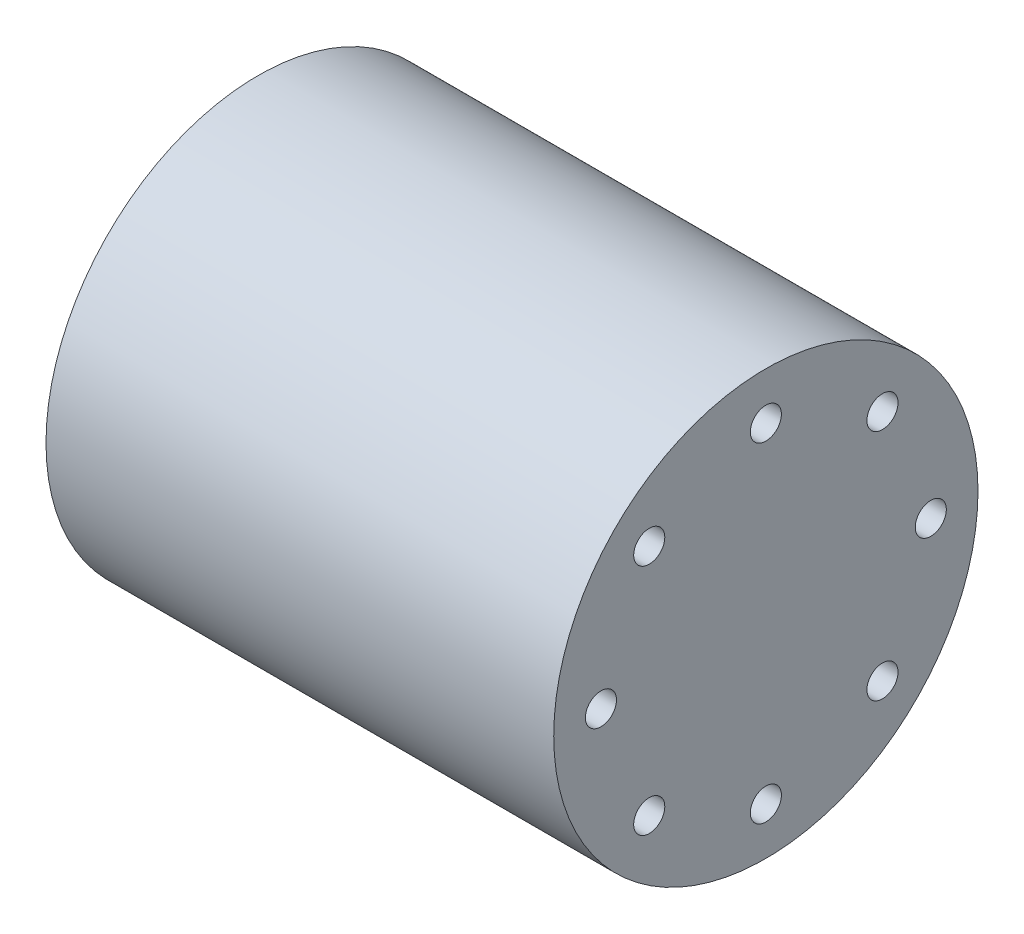
ISO-10303-21;
HEADER;
FILE_DESCRIPTION(('STEP AP214'),'2;1');
FILE_NAME('part.step','',(''),(''),'','','');
FILE_SCHEMA(('AUTOMOTIVE_DESIGN { 1 0 10303 214 1 1 1 1 }'));
ENDSEC;
DATA;
#1=APPLICATION_CONTEXT('core data for automotive mechanical design processes');
#2=APPLICATION_PROTOCOL_DEFINITION('international standard','automotive_design',2000,#1);
#3=PRODUCT_CONTEXT('',#1,'mechanical');
#4=PRODUCT('Part','Part','',(#3));
#5=PRODUCT_RELATED_PRODUCT_CATEGORY('part','',(#4));
#6=PRODUCT_DEFINITION_FORMATION('','',#4);
#7=PRODUCT_DEFINITION_CONTEXT('part definition',#1,'design');
#8=PRODUCT_DEFINITION('design','',#6,#7);
#9=PRODUCT_DEFINITION_SHAPE('','',#8);
#10=(LENGTH_UNIT() NAMED_UNIT(*) SI_UNIT(.MILLI.,.METRE.));
#11=(NAMED_UNIT(*) PLANE_ANGLE_UNIT() SI_UNIT($,.RADIAN.));
#12=(NAMED_UNIT(*) SI_UNIT($,.STERADIAN.) SOLID_ANGLE_UNIT());
#13=UNCERTAINTY_MEASURE_WITH_UNIT(LENGTH_MEASURE(1.E-05),#10,'distance_accuracy_value','');
#14=(GEOMETRIC_REPRESENTATION_CONTEXT(3) GLOBAL_UNCERTAINTY_ASSIGNED_CONTEXT((#13)) GLOBAL_UNIT_ASSIGNED_CONTEXT((#10,
#11,#12)) REPRESENTATION_CONTEXT('',''));
#15=CARTESIAN_POINT('',(0.,0.,0.));
#16=DIRECTION('',(0.,0.,1.));
#17=DIRECTION('',(1.,0.,0.));
#18=AXIS2_PLACEMENT_3D('',#15,#16,#17);
#19=CARTESIAN_POINT('',(-7.25,0.,0.));
#20=DIRECTION('',(1.,0.,0.));
#21=DIRECTION('',(0.,1.,0.));
#22=AXIS2_PLACEMENT_3D('',#19,#20,#21);
#23=PLANE('',#22);
#24=CARTESIAN_POINT('',(-7.25,17.5,0.));
#25=DIRECTION('',(1.,0.,0.));
#26=DIRECTION('',(0.,0.,-1.));
#27=AXIS2_PLACEMENT_3D('',#24,#25,#26);
#28=CIRCLE('',#27,1.65);
#29=CARTESIAN_POINT('',(-7.25,17.5,-1.65));
#30=VERTEX_POINT('',#29);
#31=EDGE_CURVE('E11',#30,#30,#28,.T.);
#32=ORIENTED_EDGE('',*,*,#31,.F.);
#33=EDGE_LOOP('',(#32));
#34=FACE_BOUND('',#33,.T.);
#35=ADVANCED_FACE('F16',(#34),#23,.F.);
#36=CARTESIAN_POINT('',(-7.25,17.5,0.));
#37=DIRECTION('',(-1.,0.,0.));
#38=DIRECTION('',(0.,0.,1.));
#39=AXIS2_PLACEMENT_3D('',#36,#37,#38);
#40=CYLINDRICAL_SURFACE('',#39,1.65);
#41=CARTESIAN_POINT('',(-27.25,17.5,0.));
#42=DIRECTION('',(1.,0.,0.));
#43=DIRECTION('',(0.,0.,-1.));
#44=AXIS2_PLACEMENT_3D('',#41,#42,#43);
#45=CIRCLE('',#44,1.65);
#46=CARTESIAN_POINT('',(-27.25,17.5,-1.65));
#47=VERTEX_POINT('',#46);
#48=EDGE_CURVE('E202',#47,#47,#45,.T.);
#49=ORIENTED_EDGE('',*,*,#48,.F.);
#50=EDGE_LOOP('',(#49));
#51=FACE_BOUND('',#50,.T.);
#52=ORIENTED_EDGE('',*,*,#31,.T.);
#53=EDGE_LOOP('',(#52));
#54=FACE_BOUND('',#53,.T.);
#55=ADVANCED_FACE('F295',(#51,#54),#40,.F.);
#56=CARTESIAN_POINT('',(-7.25,0.,0.));
#57=DIRECTION('',(1.,0.,0.));
#58=DIRECTION('',(0.,1.,0.));
#59=AXIS2_PLACEMENT_3D('',#56,#57,#58);
#60=PLANE('',#59);
#61=CARTESIAN_POINT('',(-7.25,12.3743686707646,12.3743686707646));
#62=DIRECTION('',(1.,0.,0.));
#63=DIRECTION('',(0.,0.,-1.));
#64=AXIS2_PLACEMENT_3D('',#61,#62,#63);
#65=CIRCLE('',#64,1.65);
#66=CARTESIAN_POINT('',(-7.25,12.3743686707646,10.7243686707646));
#67=VERTEX_POINT('',#66);
#68=EDGE_CURVE('E27',#67,#67,#65,.T.);
#69=ORIENTED_EDGE('',*,*,#68,.F.);
#70=EDGE_LOOP('',(#69));
#71=FACE_BOUND('',#70,.T.);
#72=ADVANCED_FACE('F300',(#71),#60,.F.);
#73=CARTESIAN_POINT('',(-7.25,12.3743686707646,12.3743686707646));
#74=DIRECTION('',(-1.,0.,0.));
#75=DIRECTION('',(0.,0.,1.));
#76=AXIS2_PLACEMENT_3D('',#73,#74,#75);
#77=CYLINDRICAL_SURFACE('',#76,1.65);
#78=CARTESIAN_POINT('',(-27.25,12.3743686707646,12.3743686707646));
#79=DIRECTION('',(1.,0.,0.));
#80=DIRECTION('',(0.,0.,-1.));
#81=AXIS2_PLACEMENT_3D('',#78,#79,#80);
#82=CIRCLE('',#81,1.65);
#83=CARTESIAN_POINT('',(-27.25,12.3743686707646,10.7243686707646));
#84=VERTEX_POINT('',#83);
#85=EDGE_CURVE('E205',#84,#84,#82,.T.);
#86=ORIENTED_EDGE('',*,*,#85,.F.);
#87=EDGE_LOOP('',(#86));
#88=FACE_BOUND('',#87,.T.);
#89=ORIENTED_EDGE('',*,*,#68,.T.);
#90=EDGE_LOOP('',(#89));
#91=FACE_BOUND('',#90,.T.);
#92=ADVANCED_FACE('F311',(#88,#91),#77,.F.);
#93=CARTESIAN_POINT('',(-7.25,0.,0.));
#94=DIRECTION('',(1.,0.,0.));
#95=DIRECTION('',(0.,1.,0.));
#96=AXIS2_PLACEMENT_3D('',#93,#94,#95);
#97=PLANE('',#96);
#98=CARTESIAN_POINT('',(-7.25,12.3743686707646,-12.3743686707646));
#99=DIRECTION('',(1.,0.,0.));
#100=DIRECTION('',(0.,0.,-1.));
#101=AXIS2_PLACEMENT_3D('',#98,#99,#100);
#102=CIRCLE('',#101,1.65);
#103=CARTESIAN_POINT('',(-7.25,12.3743686707646,-14.0243686707646));
#104=VERTEX_POINT('',#103);
#105=EDGE_CURVE('E206',#104,#104,#102,.T.);
#106=ORIENTED_EDGE('',*,*,#105,.F.);
#107=EDGE_LOOP('',(#106));
#108=FACE_BOUND('',#107,.T.);
#109=ADVANCED_FACE('F314',(#108),#97,.F.);
#110=CARTESIAN_POINT('',(-7.25,12.3743686707646,-12.3743686707646));
#111=DIRECTION('',(-1.,0.,0.));
#112=DIRECTION('',(0.,0.,1.));
#113=AXIS2_PLACEMENT_3D('',#110,#111,#112);
#114=CYLINDRICAL_SURFACE('',#113,1.65);
#115=CARTESIAN_POINT('',(-27.25,12.3743686707646,-12.3743686707646));
#116=DIRECTION('',(1.,0.,0.));
#117=DIRECTION('',(0.,0.,-1.));
#118=AXIS2_PLACEMENT_3D('',#115,#116,#117);
#119=CIRCLE('',#118,1.65);
#120=CARTESIAN_POINT('',(-27.25,12.3743686707646,-14.0243686707646));
#121=VERTEX_POINT('',#120);
#122=EDGE_CURVE('E194',#121,#121,#119,.T.);
#123=ORIENTED_EDGE('',*,*,#122,.F.);
#124=EDGE_LOOP('',(#123));
#125=FACE_BOUND('',#124,.T.);
#126=ORIENTED_EDGE('',*,*,#105,.T.);
#127=EDGE_LOOP('',(#126));
#128=FACE_BOUND('',#127,.T.);
#129=ADVANCED_FACE('F441',(#125,#128),#114,.F.);
#130=CARTESIAN_POINT('',(-7.25,0.,0.));
#131=DIRECTION('',(1.,0.,0.));
#132=DIRECTION('',(0.,1.,0.));
#133=AXIS2_PLACEMENT_3D('',#130,#131,#132);
#134=PLANE('',#133);
#135=CARTESIAN_POINT('',(-7.25,-17.5,0.));
#136=DIRECTION('',(1.,0.,0.));
#137=DIRECTION('',(0.,0.,-1.));
#138=AXIS2_PLACEMENT_3D('',#135,#136,#137);
#139=CIRCLE('',#138,1.65);
#140=CARTESIAN_POINT('',(-7.25,-17.5,-1.65));
#141=VERTEX_POINT('',#140);
#142=EDGE_CURVE('E209',#141,#141,#139,.T.);
#143=ORIENTED_EDGE('',*,*,#142,.F.);
#144=EDGE_LOOP('',(#143));
#145=FACE_BOUND('',#144,.T.);
#146=ADVANCED_FACE('F18',(#145),#134,.F.);
#147=CARTESIAN_POINT('',(-7.25,-17.5,0.));
#148=DIRECTION('',(-1.,0.,0.));
#149=DIRECTION('',(0.,0.,1.));
#150=AXIS2_PLACEMENT_3D('',#147,#148,#149);
#151=CYLINDRICAL_SURFACE('',#150,1.65);
#152=CARTESIAN_POINT('',(-27.25,-17.5,0.));
#153=DIRECTION('',(1.,0.,0.));
#154=DIRECTION('',(0.,0.,-1.));
#155=AXIS2_PLACEMENT_3D('',#152,#153,#154);
#156=CIRCLE('',#155,1.65);
#157=CARTESIAN_POINT('',(-27.25,-17.5,-1.65));
#158=VERTEX_POINT('',#157);
#159=EDGE_CURVE('E190',#158,#158,#156,.T.);
#160=ORIENTED_EDGE('',*,*,#159,.F.);
#161=EDGE_LOOP('',(#160));
#162=FACE_BOUND('',#161,.T.);
#163=ORIENTED_EDGE('',*,*,#142,.T.);
#164=EDGE_LOOP('',(#163));
#165=FACE_BOUND('',#164,.T.);
#166=ADVANCED_FACE('F326',(#162,#165),#151,.F.);
#167=CARTESIAN_POINT('',(-7.25,0.,0.));
#168=DIRECTION('',(1.,0.,0.));
#169=DIRECTION('',(0.,1.,0.));
#170=AXIS2_PLACEMENT_3D('',#167,#168,#169);
#171=PLANE('',#170);
#172=CARTESIAN_POINT('',(-7.25,-12.3743686707646,-12.3743686707646));
#173=DIRECTION('',(1.,0.,0.));
#174=DIRECTION('',(0.,0.,-1.));
#175=AXIS2_PLACEMENT_3D('',#172,#173,#174);
#176=CIRCLE('',#175,1.65);
#177=CARTESIAN_POINT('',(-7.25,-12.3743686707646,-14.0243686707646));
#178=VERTEX_POINT('',#177);
#179=EDGE_CURVE('E217',#178,#178,#176,.T.);
#180=ORIENTED_EDGE('',*,*,#179,.F.);
#181=EDGE_LOOP('',(#180));
#182=FACE_BOUND('',#181,.T.);
#183=ADVANCED_FACE('F322',(#182),#171,.F.);
#184=CARTESIAN_POINT('',(-7.25,-12.3743686707646,-12.3743686707646));
#185=DIRECTION('',(-1.,0.,0.));
#186=DIRECTION('',(0.,0.,1.));
#187=AXIS2_PLACEMENT_3D('',#184,#185,#186);
#188=CYLINDRICAL_SURFACE('',#187,1.65);
#189=CARTESIAN_POINT('',(-27.25,-12.3743686707646,-12.3743686707646));
#190=DIRECTION('',(1.,0.,0.));
#191=DIRECTION('',(0.,0.,-1.));
#192=AXIS2_PLACEMENT_3D('',#189,#190,#191);
#193=CIRCLE('',#192,1.65);
#194=CARTESIAN_POINT('',(-27.25,-12.3743686707646,-14.0243686707646));
#195=VERTEX_POINT('',#194);
#196=EDGE_CURVE('E193',#195,#195,#193,.T.);
#197=ORIENTED_EDGE('',*,*,#196,.F.);
#198=EDGE_LOOP('',(#197));
#199=FACE_BOUND('',#198,.T.);
#200=ORIENTED_EDGE('',*,*,#179,.T.);
#201=EDGE_LOOP('',(#200));
#202=FACE_BOUND('',#201,.T.);
#203=ADVANCED_FACE('F325',(#199,#202),#188,.F.);
#204=CARTESIAN_POINT('',(-7.25,0.,0.));
#205=DIRECTION('',(1.,0.,0.));
#206=DIRECTION('',(0.,1.,0.));
#207=AXIS2_PLACEMENT_3D('',#204,#205,#206);
#208=PLANE('',#207);
#209=CARTESIAN_POINT('',(-7.25,0.,-17.5));
#210=DIRECTION('',(1.,0.,0.));
#211=DIRECTION('',(0.,0.,-1.));
#212=AXIS2_PLACEMENT_3D('',#209,#210,#211);
#213=CIRCLE('',#212,1.65);
#214=CARTESIAN_POINT('',(-7.25,0.,-19.15));
#215=VERTEX_POINT('',#214);
#216=EDGE_CURVE('E225',#215,#215,#213,.T.);
#217=ORIENTED_EDGE('',*,*,#216,.F.);
#218=EDGE_LOOP('',(#217));
#219=FACE_BOUND('',#218,.T.);
#220=ADVANCED_FACE('F320',(#219),#208,.F.);
#221=CARTESIAN_POINT('',(-7.25,0.,-17.5));
#222=DIRECTION('',(-1.,0.,0.));
#223=DIRECTION('',(0.,0.,1.));
#224=AXIS2_PLACEMENT_3D('',#221,#222,#223);
#225=CYLINDRICAL_SURFACE('',#224,1.65);
#226=CARTESIAN_POINT('',(-27.25,0.,-17.5));
#227=DIRECTION('',(1.,0.,0.));
#228=DIRECTION('',(0.,0.,-1.));
#229=AXIS2_PLACEMENT_3D('',#226,#227,#228);
#230=CIRCLE('',#229,1.65);
#231=CARTESIAN_POINT('',(-27.25,0.,-19.15));
#232=VERTEX_POINT('',#231);
#233=EDGE_CURVE('E228',#232,#232,#230,.T.);
#234=ORIENTED_EDGE('',*,*,#233,.F.);
#235=EDGE_LOOP('',(#234));
#236=FACE_BOUND('',#235,.T.);
#237=ORIENTED_EDGE('',*,*,#216,.T.);
#238=EDGE_LOOP('',(#237));
#239=FACE_BOUND('',#238,.T.);
#240=ADVANCED_FACE('F316',(#236,#239),#225,.F.);
#241=CARTESIAN_POINT('',(-7.25,0.,0.));
#242=DIRECTION('',(1.,0.,0.));
#243=DIRECTION('',(0.,1.,0.));
#244=AXIS2_PLACEMENT_3D('',#241,#242,#243);
#245=PLANE('',#244);
#246=CARTESIAN_POINT('',(-7.25,0.,17.5));
#247=DIRECTION('',(1.,0.,0.));
#248=DIRECTION('',(0.,0.,-1.));
#249=AXIS2_PLACEMENT_3D('',#246,#247,#248);
#250=CIRCLE('',#249,1.65);
#251=CARTESIAN_POINT('',(-7.25,0.,15.85));
#252=VERTEX_POINT('',#251);
#253=EDGE_CURVE('E235',#252,#252,#250,.T.);
#254=ORIENTED_EDGE('',*,*,#253,.F.);
#255=EDGE_LOOP('',(#254));
#256=FACE_BOUND('',#255,.T.);
#257=ADVANCED_FACE('F319',(#256),#245,.F.);
#258=CARTESIAN_POINT('',(-7.25,0.,17.5));
#259=DIRECTION('',(-1.,0.,0.));
#260=DIRECTION('',(0.,0.,1.));
#261=AXIS2_PLACEMENT_3D('',#258,#259,#260);
#262=CYLINDRICAL_SURFACE('',#261,1.65);
#263=CARTESIAN_POINT('',(-27.25,0.,17.5));
#264=DIRECTION('',(1.,0.,0.));
#265=DIRECTION('',(0.,0.,-1.));
#266=AXIS2_PLACEMENT_3D('',#263,#264,#265);
#267=CIRCLE('',#266,1.65);
#268=CARTESIAN_POINT('',(-27.25,0.,15.85));
#269=VERTEX_POINT('',#268);
#270=EDGE_CURVE('E231',#269,#269,#267,.T.);
#271=ORIENTED_EDGE('',*,*,#270,.F.);
#272=EDGE_LOOP('',(#271));
#273=FACE_BOUND('',#272,.T.);
#274=ORIENTED_EDGE('',*,*,#253,.T.);
#275=EDGE_LOOP('',(#274));
#276=FACE_BOUND('',#275,.T.);
#277=ADVANCED_FACE('F418',(#273,#276),#262,.F.);
#278=CARTESIAN_POINT('',(-7.25,0.,0.));
#279=DIRECTION('',(1.,0.,0.));
#280=DIRECTION('',(0.,1.,0.));
#281=AXIS2_PLACEMENT_3D('',#278,#279,#280);
#282=PLANE('',#281);
#283=CARTESIAN_POINT('',(-7.25,-12.3743686707646,12.3743686707646));
#284=DIRECTION('',(1.,0.,0.));
#285=DIRECTION('',(0.,0.,-1.));
#286=AXIS2_PLACEMENT_3D('',#283,#284,#285);
#287=CIRCLE('',#286,1.65);
#288=CARTESIAN_POINT('',(-7.25,-12.3743686707646,10.7243686707646));
#289=VERTEX_POINT('',#288);
#290=EDGE_CURVE('E232',#289,#289,#287,.T.);
#291=ORIENTED_EDGE('',*,*,#290,.F.);
#292=EDGE_LOOP('',(#291));
#293=FACE_BOUND('',#292,.T.);
#294=ADVANCED_FACE('F352',(#293),#282,.F.);
#295=CARTESIAN_POINT('',(-7.25,-12.3743686707646,12.3743686707646));
#296=DIRECTION('',(-1.,0.,0.));
#297=DIRECTION('',(0.,0.,1.));
#298=AXIS2_PLACEMENT_3D('',#295,#296,#297);
#299=CYLINDRICAL_SURFACE('',#298,1.65);
#300=CARTESIAN_POINT('',(-27.25,-12.3743686707646,12.3743686707646));
#301=DIRECTION('',(1.,0.,0.));
#302=DIRECTION('',(0.,0.,-1.));
#303=AXIS2_PLACEMENT_3D('',#300,#301,#302);
#304=CIRCLE('',#303,1.65);
#305=CARTESIAN_POINT('',(-27.25,-12.3743686707646,10.7243686707646));
#306=VERTEX_POINT('',#305);
#307=EDGE_CURVE('E240',#306,#306,#304,.T.);
#308=ORIENTED_EDGE('',*,*,#307,.F.);
#309=EDGE_LOOP('',(#308));
#310=FACE_BOUND('',#309,.T.);
#311=ORIENTED_EDGE('',*,*,#290,.T.);
#312=EDGE_LOOP('',(#311));
#313=FACE_BOUND('',#312,.T.);
#314=ADVANCED_FACE('F349',(#310,#313),#299,.F.);
#315=CARTESIAN_POINT('',(6.625,0.,0.));
#316=DIRECTION('',(1.,0.,0.));
#317=DIRECTION('',(0.,1.,0.));
#318=AXIS2_PLACEMENT_3D('',#315,#316,#317);
#319=PLANE('',#318);
#320=CARTESIAN_POINT('',(6.625,0.,17.5));
#321=DIRECTION('',(1.,0.,0.));
#322=DIRECTION('',(0.,0.,-1.));
#323=AXIS2_PLACEMENT_3D('',#320,#321,#322);
#324=CIRCLE('',#323,1.65);
#325=CARTESIAN_POINT('',(6.625,0.,15.85));
#326=VERTEX_POINT('',#325);
#327=EDGE_CURVE('E236',#326,#326,#324,.T.);
#328=ORIENTED_EDGE('',*,*,#327,.T.);
#329=EDGE_LOOP('',(#328));
#330=FACE_BOUND('',#329,.T.);
#331=ADVANCED_FACE('F351',(#330),#319,.T.);
#332=CARTESIAN_POINT('',(6.625,0.,17.5));
#333=DIRECTION('',(1.,0.,0.));
#334=DIRECTION('',(0.,0.,-1.));
#335=AXIS2_PLACEMENT_3D('',#332,#333,#334);
#336=CYLINDRICAL_SURFACE('',#335,1.65);
#337=CARTESIAN_POINT('',(26.625,0.,17.5));
#338=DIRECTION('',(1.,0.,0.));
#339=DIRECTION('',(0.,0.,-1.));
#340=AXIS2_PLACEMENT_3D('',#337,#338,#339);
#341=CIRCLE('',#340,1.65);
#342=CARTESIAN_POINT('',(26.625,0.,15.85));
#343=VERTEX_POINT('',#342);
#344=EDGE_CURVE('E20',#343,#343,#341,.T.);
#345=ORIENTED_EDGE('',*,*,#344,.T.);
#346=EDGE_LOOP('',(#345));
#347=FACE_BOUND('',#346,.T.);
#348=ORIENTED_EDGE('',*,*,#327,.F.);
#349=EDGE_LOOP('',(#348));
#350=FACE_BOUND('',#349,.T.);
#351=ADVANCED_FACE('F344',(#347,#350),#336,.F.);
#352=CARTESIAN_POINT('',(6.625,0.,0.));
#353=DIRECTION('',(1.,0.,0.));
#354=DIRECTION('',(0.,1.,0.));
#355=AXIS2_PLACEMENT_3D('',#352,#353,#354);
#356=PLANE('',#355);
#357=CARTESIAN_POINT('',(6.625,0.,-17.5));
#358=DIRECTION('',(1.,0.,0.));
#359=DIRECTION('',(0.,0.,-1.));
#360=AXIS2_PLACEMENT_3D('',#357,#358,#359);
#361=CIRCLE('',#360,1.65);
#362=CARTESIAN_POINT('',(6.625,0.,-19.15));
#363=VERTEX_POINT('',#362);
#364=EDGE_CURVE('E244',#363,#363,#361,.T.);
#365=ORIENTED_EDGE('',*,*,#364,.T.);
#366=EDGE_LOOP('',(#365));
#367=FACE_BOUND('',#366,.T.);
#368=ADVANCED_FACE('F340',(#367),#356,.T.);
#369=CARTESIAN_POINT('',(6.625,0.,-17.5));
#370=DIRECTION('',(1.,0.,0.));
#371=DIRECTION('',(0.,0.,-1.));
#372=AXIS2_PLACEMENT_3D('',#369,#370,#371);
#373=CYLINDRICAL_SURFACE('',#372,1.65);
#374=CARTESIAN_POINT('',(26.625,0.,-17.5));
#375=DIRECTION('',(1.,0.,0.));
#376=DIRECTION('',(0.,0.,-1.));
#377=AXIS2_PLACEMENT_3D('',#374,#375,#376);
#378=CIRCLE('',#377,1.65);
#379=CARTESIAN_POINT('',(26.625,0.,-19.15));
#380=VERTEX_POINT('',#379);
#381=EDGE_CURVE('E182',#380,#380,#378,.T.);
#382=ORIENTED_EDGE('',*,*,#381,.T.);
#383=EDGE_LOOP('',(#382));
#384=FACE_BOUND('',#383,.T.);
#385=ORIENTED_EDGE('',*,*,#364,.F.);
#386=EDGE_LOOP('',(#385));
#387=FACE_BOUND('',#386,.T.);
#388=ADVANCED_FACE('F343',(#384,#387),#373,.F.);
#389=CARTESIAN_POINT('',(6.625,0.,0.));
#390=DIRECTION('',(1.,0.,0.));
#391=DIRECTION('',(0.,1.,0.));
#392=AXIS2_PLACEMENT_3D('',#389,#390,#391);
#393=PLANE('',#392);
#394=CARTESIAN_POINT('',(6.625,-12.3743686707646,-12.3743686707646));
#395=DIRECTION('',(1.,0.,0.));
#396=DIRECTION('',(0.,0.,-1.));
#397=AXIS2_PLACEMENT_3D('',#394,#395,#396);
#398=CIRCLE('',#397,1.65);
#399=CARTESIAN_POINT('',(6.625,-12.3743686707646,-14.0243686707646));
#400=VERTEX_POINT('',#399);
#401=EDGE_CURVE('E186',#400,#400,#398,.T.);
#402=ORIENTED_EDGE('',*,*,#401,.T.);
#403=EDGE_LOOP('',(#402));
#404=FACE_BOUND('',#403,.T.);
#405=ADVANCED_FACE('F354',(#404),#393,.T.);
#406=CARTESIAN_POINT('',(6.625,-12.3743686707646,-12.3743686707646));
#407=DIRECTION('',(1.,0.,0.));
#408=DIRECTION('',(0.,0.,-1.));
#409=AXIS2_PLACEMENT_3D('',#406,#407,#408);
#410=CYLINDRICAL_SURFACE('',#409,1.65);
#411=CARTESIAN_POINT('',(26.625,-12.3743686707646,-12.3743686707646));
#412=DIRECTION('',(1.,0.,0.));
#413=DIRECTION('',(0.,0.,-1.));
#414=AXIS2_PLACEMENT_3D('',#411,#412,#413);
#415=CIRCLE('',#414,1.65);
#416=CARTESIAN_POINT('',(26.625,-12.3743686707646,-14.0243686707646));
#417=VERTEX_POINT('',#416);
#418=EDGE_CURVE('E172',#417,#417,#415,.T.);
#419=ORIENTED_EDGE('',*,*,#418,.T.);
#420=EDGE_LOOP('',(#419));
#421=FACE_BOUND('',#420,.T.);
#422=ORIENTED_EDGE('',*,*,#401,.F.);
#423=EDGE_LOOP('',(#422));
#424=FACE_BOUND('',#423,.T.);
#425=ADVANCED_FACE('F356',(#421,#424),#410,.F.);
#426=CARTESIAN_POINT('',(6.625,0.,0.));
#427=DIRECTION('',(1.,0.,0.));
#428=DIRECTION('',(0.,1.,0.));
#429=AXIS2_PLACEMENT_3D('',#426,#427,#428);
#430=PLANE('',#429);
#431=CARTESIAN_POINT('',(6.625,-17.5,0.));
#432=DIRECTION('',(1.,0.,0.));
#433=DIRECTION('',(0.,0.,-1.));
#434=AXIS2_PLACEMENT_3D('',#431,#432,#433);
#435=CIRCLE('',#434,1.65);
#436=CARTESIAN_POINT('',(6.625,-17.5,-1.65));
#437=VERTEX_POINT('',#436);
#438=EDGE_CURVE('E195',#437,#437,#435,.T.);
#439=ORIENTED_EDGE('',*,*,#438,.T.);
#440=EDGE_LOOP('',(#439));
#441=FACE_BOUND('',#440,.T.);
#442=ADVANCED_FACE('F361',(#441),#430,.T.);
#443=CARTESIAN_POINT('',(6.625,-17.5,0.));
#444=DIRECTION('',(1.,0.,0.));
#445=DIRECTION('',(0.,0.,-1.));
#446=AXIS2_PLACEMENT_3D('',#443,#444,#445);
#447=CYLINDRICAL_SURFACE('',#446,1.65);
#448=CARTESIAN_POINT('',(26.625,-17.5,0.));
#449=DIRECTION('',(1.,0.,0.));
#450=DIRECTION('',(0.,0.,-1.));
#451=AXIS2_PLACEMENT_3D('',#448,#449,#450);
#452=CIRCLE('',#451,1.65);
#453=CARTESIAN_POINT('',(26.625,-17.5,-1.65));
#454=VERTEX_POINT('',#453);
#455=EDGE_CURVE('E166',#454,#454,#452,.T.);
#456=ORIENTED_EDGE('',*,*,#455,.T.);
#457=EDGE_LOOP('',(#456));
#458=FACE_BOUND('',#457,.T.);
#459=ORIENTED_EDGE('',*,*,#438,.F.);
#460=EDGE_LOOP('',(#459));
#461=FACE_BOUND('',#460,.T.);
#462=ADVANCED_FACE('F167',(#458,#461),#447,.F.);
#463=CARTESIAN_POINT('',(6.625,0.,0.));
#464=DIRECTION('',(1.,0.,0.));
#465=DIRECTION('',(0.,1.,0.));
#466=AXIS2_PLACEMENT_3D('',#463,#464,#465);
#467=PLANE('',#466);
#468=CARTESIAN_POINT('',(6.625,-12.3743686707646,12.3743686707646));
#469=DIRECTION('',(1.,0.,0.));
#470=DIRECTION('',(0.,0.,-1.));
#471=AXIS2_PLACEMENT_3D('',#468,#469,#470);
#472=CIRCLE('',#471,1.65);
#473=CARTESIAN_POINT('',(6.625,-12.3743686707646,10.7243686707646));
#474=VERTEX_POINT('',#473);
#475=EDGE_CURVE('E198',#474,#474,#472,.T.);
#476=ORIENTED_EDGE('',*,*,#475,.T.);
#477=EDGE_LOOP('',(#476));
#478=FACE_BOUND('',#477,.T.);
#479=ADVANCED_FACE('F306',(#478),#467,.T.);
#480=CARTESIAN_POINT('',(6.625,-12.3743686707646,12.3743686707646));
#481=DIRECTION('',(1.,0.,0.));
#482=DIRECTION('',(0.,0.,-1.));
#483=AXIS2_PLACEMENT_3D('',#480,#481,#482);
#484=CYLINDRICAL_SURFACE('',#483,1.65);
#485=CARTESIAN_POINT('',(26.625,-12.3743686707646,12.3743686707646));
#486=DIRECTION('',(1.,0.,0.));
#487=DIRECTION('',(0.,0.,-1.));
#488=AXIS2_PLACEMENT_3D('',#485,#486,#487);
#489=CIRCLE('',#488,1.65);
#490=CARTESIAN_POINT('',(26.625,-12.3743686707646,10.7243686707646));
#491=VERTEX_POINT('',#490);
#492=EDGE_CURVE('E171',#491,#491,#489,.T.);
#493=ORIENTED_EDGE('',*,*,#492,.T.);
#494=EDGE_LOOP('',(#493));
#495=FACE_BOUND('',#494,.T.);
#496=ORIENTED_EDGE('',*,*,#475,.F.);
#497=EDGE_LOOP('',(#496));
#498=FACE_BOUND('',#497,.T.);
#499=ADVANCED_FACE('F308',(#495,#498),#484,.F.);
#500=CARTESIAN_POINT('',(6.625,0.,0.));
#501=DIRECTION('',(1.,0.,0.));
#502=DIRECTION('',(0.,1.,0.));
#503=AXIS2_PLACEMENT_3D('',#500,#501,#502);
#504=PLANE('',#503);
#505=CARTESIAN_POINT('',(6.625,12.3743686707646,-12.3743686707646));
#506=DIRECTION('',(1.,0.,0.));
#507=DIRECTION('',(0.,0.,-1.));
#508=AXIS2_PLACEMENT_3D('',#505,#506,#507);
#509=CIRCLE('',#508,1.65);
#510=CARTESIAN_POINT('',(6.625,12.3743686707646,-14.0243686707646));
#511=VERTEX_POINT('',#510);
#512=EDGE_CURVE('E243',#511,#511,#509,.T.);
#513=ORIENTED_EDGE('',*,*,#512,.T.);
#514=EDGE_LOOP('',(#513));
#515=FACE_BOUND('',#514,.T.);
#516=ADVANCED_FACE('F305',(#515),#504,.T.);
#517=CARTESIAN_POINT('',(6.625,12.3743686707646,-12.3743686707646));
#518=DIRECTION('',(1.,0.,0.));
#519=DIRECTION('',(0.,0.,-1.));
#520=AXIS2_PLACEMENT_3D('',#517,#518,#519);
#521=CYLINDRICAL_SURFACE('',#520,1.65);
#522=CARTESIAN_POINT('',(26.625,12.3743686707646,-12.3743686707646));
#523=DIRECTION('',(1.,0.,0.));
#524=DIRECTION('',(0.,0.,-1.));
#525=AXIS2_PLACEMENT_3D('',#522,#523,#524);
#526=CIRCLE('',#525,1.65);
#527=CARTESIAN_POINT('',(26.625,12.3743686707646,-14.0243686707646));
#528=VERTEX_POINT('',#527);
#529=EDGE_CURVE('E179',#528,#528,#526,.T.);
#530=ORIENTED_EDGE('',*,*,#529,.T.);
#531=EDGE_LOOP('',(#530));
#532=FACE_BOUND('',#531,.T.);
#533=ORIENTED_EDGE('',*,*,#512,.F.);
#534=EDGE_LOOP('',(#533));
#535=FACE_BOUND('',#534,.T.);
#536=ADVANCED_FACE('F290',(#532,#535),#521,.F.);
#537=CARTESIAN_POINT('',(6.625,0.,0.));
#538=DIRECTION('',(1.,0.,0.));
#539=DIRECTION('',(0.,1.,0.));
#540=AXIS2_PLACEMENT_3D('',#537,#538,#539);
#541=PLANE('',#540);
#542=CARTESIAN_POINT('',(6.625,12.3743686707646,12.3743686707646));
#543=DIRECTION('',(1.,0.,0.));
#544=DIRECTION('',(0.,0.,-1.));
#545=AXIS2_PLACEMENT_3D('',#542,#543,#544);
#546=CIRCLE('',#545,1.65);
#547=CARTESIAN_POINT('',(6.625,12.3743686707646,10.7243686707646));
#548=VERTEX_POINT('',#547);
#549=EDGE_CURVE('E252',#548,#548,#546,.T.);
#550=ORIENTED_EDGE('',*,*,#549,.T.);
#551=EDGE_LOOP('',(#550));
#552=FACE_BOUND('',#551,.T.);
#553=ADVANCED_FACE('F276',(#552),#541,.T.);
#554=CARTESIAN_POINT('',(6.625,12.3743686707646,12.3743686707646));
#555=DIRECTION('',(1.,0.,0.));
#556=DIRECTION('',(0.,0.,-1.));
#557=AXIS2_PLACEMENT_3D('',#554,#555,#556);
#558=CYLINDRICAL_SURFACE('',#557,1.65);
#559=CARTESIAN_POINT('',(26.625,12.3743686707646,12.3743686707646));
#560=DIRECTION('',(1.,0.,0.));
#561=DIRECTION('',(0.,0.,-1.));
#562=AXIS2_PLACEMENT_3D('',#559,#560,#561);
#563=CIRCLE('',#562,1.65);
#564=CARTESIAN_POINT('',(26.625,12.3743686707646,10.7243686707646));
#565=VERTEX_POINT('',#564);
#566=EDGE_CURVE('E203',#565,#565,#563,.T.);
#567=ORIENTED_EDGE('',*,*,#566,.T.);
#568=EDGE_LOOP('',(#567));
#569=FACE_BOUND('',#568,.T.);
#570=ORIENTED_EDGE('',*,*,#549,.F.);
#571=EDGE_LOOP('',(#570));
#572=FACE_BOUND('',#571,.T.);
#573=ADVANCED_FACE('F278',(#569,#572),#558,.F.);
#574=CARTESIAN_POINT('',(6.625,0.,0.));
#575=DIRECTION('',(1.,0.,0.));
#576=DIRECTION('',(0.,1.,0.));
#577=AXIS2_PLACEMENT_3D('',#574,#575,#576);
#578=PLANE('',#577);
#579=CARTESIAN_POINT('',(6.625,17.5,0.));
#580=DIRECTION('',(1.,0.,0.));
#581=DIRECTION('',(0.,0.,-1.));
#582=AXIS2_PLACEMENT_3D('',#579,#580,#581);
#583=CIRCLE('',#582,1.65);
#584=CARTESIAN_POINT('',(6.625,17.5,-1.65));
#585=VERTEX_POINT('',#584);
#586=EDGE_CURVE('E250',#585,#585,#583,.T.);
#587=ORIENTED_EDGE('',*,*,#586,.T.);
#588=EDGE_LOOP('',(#587));
#589=FACE_BOUND('',#588,.T.);
#590=ADVANCED_FACE('F280',(#589),#578,.T.);
#591=CARTESIAN_POINT('',(6.625,17.5,0.));
#592=DIRECTION('',(1.,0.,0.));
#593=DIRECTION('',(0.,0.,-1.));
#594=AXIS2_PLACEMENT_3D('',#591,#592,#593);
#595=CYLINDRICAL_SURFACE('',#594,1.65);
#596=CARTESIAN_POINT('',(26.625,17.5,0.));
#597=DIRECTION('',(1.,0.,0.));
#598=DIRECTION('',(0.,0.,-1.));
#599=AXIS2_PLACEMENT_3D('',#596,#597,#598);
#600=CIRCLE('',#599,1.65);
#601=CARTESIAN_POINT('',(26.625,17.5,-1.65));
#602=VERTEX_POINT('',#601);
#603=EDGE_CURVE('E199',#602,#602,#600,.T.);
#604=ORIENTED_EDGE('',*,*,#603,.T.);
#605=EDGE_LOOP('',(#604));
#606=FACE_BOUND('',#605,.T.);
#607=ORIENTED_EDGE('',*,*,#586,.F.);
#608=EDGE_LOOP('',(#607));
#609=FACE_BOUND('',#608,.T.);
#610=ADVANCED_FACE('F287',(#606,#609),#595,.F.);
#611=CARTESIAN_POINT('',(-27.25,0.,0.));
#612=DIRECTION('',(1.,0.,0.));
#613=DIRECTION('',(0.,1.,0.));
#614=AXIS2_PLACEMENT_3D('',#611,#612,#613);
#615=PLANE('',#614);
#616=CARTESIAN_POINT('',(-27.25,0.,0.));
#617=DIRECTION('',(1.,0.,0.));
#618=DIRECTION('',(0.,0.,-1.));
#619=AXIS2_PLACEMENT_3D('',#616,#617,#618);
#620=CIRCLE('',#619,22.51);
#621=CARTESIAN_POINT('',(-27.25,0.,-22.51));
#622=VERTEX_POINT('',#621);
#623=EDGE_CURVE('E265',#622,#622,#620,.T.);
#624=ORIENTED_EDGE('',*,*,#623,.F.);
#625=EDGE_LOOP('',(#624));
#626=FACE_BOUND('',#625,.T.);
#627=ORIENTED_EDGE('',*,*,#307,.T.);
#628=EDGE_LOOP('',(#627));
#629=FACE_BOUND('',#628,.T.);
#630=ORIENTED_EDGE('',*,*,#270,.T.);
#631=EDGE_LOOP('',(#630));
#632=FACE_BOUND('',#631,.T.);
#633=ORIENTED_EDGE('',*,*,#233,.T.);
#634=EDGE_LOOP('',(#633));
#635=FACE_BOUND('',#634,.T.);
#636=ORIENTED_EDGE('',*,*,#196,.T.);
#637=EDGE_LOOP('',(#636));
#638=FACE_BOUND('',#637,.T.);
#639=ORIENTED_EDGE('',*,*,#159,.T.);
#640=EDGE_LOOP('',(#639));
#641=FACE_BOUND('',#640,.T.);
#642=ORIENTED_EDGE('',*,*,#122,.T.);
#643=EDGE_LOOP('',(#642));
#644=FACE_BOUND('',#643,.T.);
#645=ORIENTED_EDGE('',*,*,#85,.T.);
#646=EDGE_LOOP('',(#645));
#647=FACE_BOUND('',#646,.T.);
#648=ORIENTED_EDGE('',*,*,#48,.T.);
#649=EDGE_LOOP('',(#648));
#650=FACE_BOUND('',#649,.T.);
#651=ADVANCED_FACE('F332',(#626,#629,#632,#635,#638,#641,#644,#647,#650),#615,.F.);
#652=CARTESIAN_POINT('',(26.625,0.,0.));
#653=DIRECTION('',(1.,0.,0.));
#654=DIRECTION('',(0.,1.,0.));
#655=AXIS2_PLACEMENT_3D('',#652,#653,#654);
#656=PLANE('',#655);
#657=CARTESIAN_POINT('',(26.625,0.,0.));
#658=DIRECTION('',(1.,0.,0.));
#659=DIRECTION('',(0.,0.,-1.));
#660=AXIS2_PLACEMENT_3D('',#657,#658,#659);
#661=CIRCLE('',#660,22.51);
#662=CARTESIAN_POINT('',(26.625,0.,-22.51));
#663=VERTEX_POINT('',#662);
#664=EDGE_CURVE('E267',#663,#663,#661,.T.);
#665=ORIENTED_EDGE('',*,*,#664,.T.);
#666=EDGE_LOOP('',(#665));
#667=FACE_BOUND('',#666,.T.);
#668=ORIENTED_EDGE('',*,*,#603,.F.);
#669=EDGE_LOOP('',(#668));
#670=FACE_BOUND('',#669,.T.);
#671=ORIENTED_EDGE('',*,*,#566,.F.);
#672=EDGE_LOOP('',(#671));
#673=FACE_BOUND('',#672,.T.);
#674=ORIENTED_EDGE('',*,*,#529,.F.);
#675=EDGE_LOOP('',(#674));
#676=FACE_BOUND('',#675,.T.);
#677=ORIENTED_EDGE('',*,*,#492,.F.);
#678=EDGE_LOOP('',(#677));
#679=FACE_BOUND('',#678,.T.);
#680=ORIENTED_EDGE('',*,*,#455,.F.);
#681=EDGE_LOOP('',(#680));
#682=FACE_BOUND('',#681,.T.);
#683=ORIENTED_EDGE('',*,*,#418,.F.);
#684=EDGE_LOOP('',(#683));
#685=FACE_BOUND('',#684,.T.);
#686=ORIENTED_EDGE('',*,*,#381,.F.);
#687=EDGE_LOOP('',(#686));
#688=FACE_BOUND('',#687,.T.);
#689=ORIENTED_EDGE('',*,*,#344,.F.);
#690=EDGE_LOOP('',(#689));
#691=FACE_BOUND('',#690,.T.);
#692=ADVANCED_FACE('F328',(#667,#670,#673,#676,#679,#682,#685,#688,#691),#656,.T.);
#693=CARTESIAN_POINT('',(26.,0.,0.));
#694=DIRECTION('',(-1.,0.,0.));
#695=DIRECTION('',(0.,0.,1.));
#696=AXIS2_PLACEMENT_3D('',#693,#694,#695);
#697=CYLINDRICAL_SURFACE('',#696,22.51);
#698=ORIENTED_EDGE('',*,*,#623,.T.);
#699=EDGE_LOOP('',(#698));
#700=FACE_BOUND('',#699,.T.);
#701=ORIENTED_EDGE('',*,*,#664,.F.);
#702=EDGE_LOOP('',(#701));
#703=FACE_BOUND('',#702,.T.);
#704=ADVANCED_FACE('F331',(#700,#703),#697,.T.);
#705=CLOSED_SHELL('',(#35,#55,#72,#92,#109,#129,#146,#166,#183,#203,#220,#240,#257,#277,#294,
#314,#331,#351,#368,#388,#405,#425,#442,#462,#479,#499,#516,#536,#553,#573,#590,#610,#651,#692,#704));
#706=MANIFOLD_SOLID_BREP('B1',#705);
#707=ADVANCED_BREP_SHAPE_REPRESENTATION('',(#18,#706),#14);
#708=SHAPE_DEFINITION_REPRESENTATION(#9,#707);
ENDSEC;
END-ISO-10303-21;
